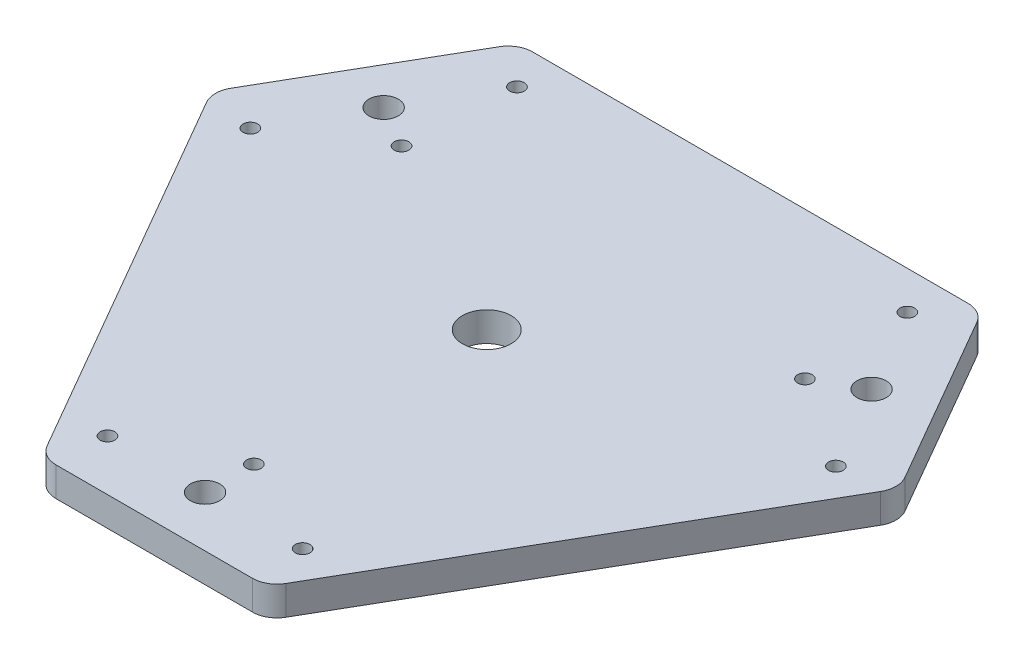
ISO-10303-21;
HEADER;
FILE_DESCRIPTION(('STEP AP214'),'2;1');
FILE_NAME('part.step','',(''),(''),'','','');
FILE_SCHEMA(('AUTOMOTIVE_DESIGN { 1 0 10303 214 1 1 1 1 }'));
ENDSEC;
DATA;
#1=APPLICATION_CONTEXT('core data for automotive mechanical design processes');
#2=APPLICATION_PROTOCOL_DEFINITION('international standard','automotive_design',2000,#1);
#3=PRODUCT_CONTEXT('',#1,'mechanical');
#4=PRODUCT('Part','Part','',(#3));
#5=PRODUCT_RELATED_PRODUCT_CATEGORY('part','',(#4));
#6=PRODUCT_DEFINITION_FORMATION('','',#4);
#7=PRODUCT_DEFINITION_CONTEXT('part definition',#1,'design');
#8=PRODUCT_DEFINITION('design','',#6,#7);
#9=PRODUCT_DEFINITION_SHAPE('','',#8);
#10=(LENGTH_UNIT() NAMED_UNIT(*) SI_UNIT(.MILLI.,.METRE.));
#11=(NAMED_UNIT(*) PLANE_ANGLE_UNIT() SI_UNIT($,.RADIAN.));
#12=(NAMED_UNIT(*) SI_UNIT($,.STERADIAN.) SOLID_ANGLE_UNIT());
#13=UNCERTAINTY_MEASURE_WITH_UNIT(LENGTH_MEASURE(1.E-05),#10,'distance_accuracy_value','');
#14=(GEOMETRIC_REPRESENTATION_CONTEXT(3) GLOBAL_UNCERTAINTY_ASSIGNED_CONTEXT((#13)) GLOBAL_UNIT_ASSIGNED_CONTEXT((#10,
#11,#12)) REPRESENTATION_CONTEXT('',''));
#15=CARTESIAN_POINT('',(0.,0.,0.));
#16=DIRECTION('',(0.,0.,1.));
#17=DIRECTION('',(1.,0.,0.));
#18=AXIS2_PLACEMENT_3D('',#15,#16,#17);
#19=CARTESIAN_POINT('',(-70.5153718043597,6.,-14.1362066797608));
#20=DIRECTION('',(0.866025403784439,0.,0.5));
#21=DIRECTION('',(0.5,0.,-0.866025403784439));
#22=AXIS2_PLACEMENT_3D('',#19,#20,#21);
#23=PLANE('',#22);
#24=DIRECTION('',(-0.5,0.,0.866025403784438));
#25=VECTOR('',#24,1.);
#26=CARTESIAN_POINT('',(-70.5153718043597,0.,-14.1362066797608));
#27=LINE('',#26,#25);
#28=CARTESIAN_POINT('',(-48.9433756729741,0.,-51.5));
#29=VERTEX_POINT('',#28);
#30=CARTESIAN_POINT('',(-69.0719961313856,0.,-16.6362066797608));
#31=VERTEX_POINT('',#30);
#32=EDGE_CURVE('E155',#29,#31,#27,.T.);
#33=ORIENTED_EDGE('',*,*,#32,.T.);
#34=DIRECTION('',(0.,-1.,0.));
#35=VECTOR('',#34,1.);
#36=CARTESIAN_POINT('',(-69.0719961313856,6.,-16.6362066797608));
#37=LINE('',#36,#35);
#38=CARTESIAN_POINT('',(-69.0719961313856,6.,-16.6362066797608));
#39=VERTEX_POINT('',#38);
#40=EDGE_CURVE('E132',#31,#39,#37,.F.);
#41=ORIENTED_EDGE('',*,*,#40,.T.);
#42=DIRECTION('',(-0.5,0.,0.866025403784438));
#43=VECTOR('',#42,1.);
#44=CARTESIAN_POINT('',(-70.5153718043597,6.,-14.1362066797608));
#45=LINE('',#44,#43);
#46=CARTESIAN_POINT('',(-48.9433756729741,6.,-51.5));
#47=VERTEX_POINT('',#46);
#48=EDGE_CURVE('E171',#47,#39,#45,.T.);
#49=ORIENTED_EDGE('',*,*,#48,.F.);
#50=DIRECTION('',(0.,-1.,0.));
#51=VECTOR('',#50,1.);
#52=CARTESIAN_POINT('',(-48.9433756729741,6.,-51.5));
#53=LINE('',#52,#51);
#54=EDGE_CURVE('E137',#47,#29,#53,.T.);
#55=ORIENTED_EDGE('',*,*,#54,.T.);
#56=EDGE_LOOP('',(#33,#41,#49,#55));
#57=FACE_BOUND('',#56,.T.);
#58=ADVANCED_FACE('F36',(#57),#23,.F.);
#59=CARTESIAN_POINT('',(-23.0153718043597,6.,68.1362066797608));
#60=DIRECTION('',(0.866025403784438,0.,-0.5));
#61=DIRECTION('',(-0.5,0.,-0.866025403784439));
#62=AXIS2_PLACEMENT_3D('',#59,#60,#61);
#63=PLANE('',#62);
#64=DIRECTION('',(0.5,0.,0.866025403784439));
#65=VECTOR('',#64,1.);
#66=CARTESIAN_POINT('',(-23.0153718043597,6.,68.1362066797608));
#67=LINE('',#66,#65);
#68=CARTESIAN_POINT('',(-69.0719961313856,6.,-11.6362066797608));
#69=VERTEX_POINT('',#68);
#70=CARTESIAN_POINT('',(-24.4587474773338,6.,65.6362066797608));
#71=VERTEX_POINT('',#70);
#72=EDGE_CURVE('E147',#69,#71,#67,.T.);
#73=ORIENTED_EDGE('',*,*,#72,.F.);
#74=DIRECTION('',(0.,-1.,0.));
#75=VECTOR('',#74,1.);
#76=CARTESIAN_POINT('',(-69.0719961313856,6.,-11.6362066797608));
#77=LINE('',#76,#75);
#78=CARTESIAN_POINT('',(-69.0719961313856,0.,-11.6362066797608));
#79=VERTEX_POINT('',#78);
#80=EDGE_CURVE('E131',#69,#79,#77,.T.);
#81=ORIENTED_EDGE('',*,*,#80,.T.);
#82=DIRECTION('',(0.5,0.,0.866025403784439));
#83=VECTOR('',#82,1.);
#84=CARTESIAN_POINT('',(-23.0153718043597,0.,68.1362066797608));
#85=LINE('',#84,#83);
#86=CARTESIAN_POINT('',(-24.4587474773338,0.,65.6362066797608));
#87=VERTEX_POINT('',#86);
#88=EDGE_CURVE('E144',#79,#87,#85,.T.);
#89=ORIENTED_EDGE('',*,*,#88,.T.);
#90=DIRECTION('',(0.,-1.,0.));
#91=VECTOR('',#90,1.);
#92=CARTESIAN_POINT('',(-24.4587474773338,6.,65.6362066797608));
#93=LINE('',#92,#91);
#94=EDGE_CURVE('E149',#87,#71,#93,.F.);
#95=ORIENTED_EDGE('',*,*,#94,.T.);
#96=EDGE_LOOP('',(#73,#81,#89,#95));
#97=FACE_BOUND('',#96,.T.);
#98=ADVANCED_FACE('F143',(#97),#63,.F.);
#99=CARTESIAN_POINT('',(23.0153718043597,6.,68.1362066797608));
#100=DIRECTION('',(0.,0.,-1.));
#101=DIRECTION('',(-1.,0.,0.));
#102=AXIS2_PLACEMENT_3D('',#99,#100,#101);
#103=PLANE('',#102);
#104=DIRECTION('',(1.,0.,0.));
#105=VECTOR('',#104,1.);
#106=CARTESIAN_POINT('',(23.0153718043597,6.,68.1362066797608));
#107=LINE('',#106,#105);
#108=CARTESIAN_POINT('',(-20.1286204584116,6.,68.1362066797608));
#109=VERTEX_POINT('',#108);
#110=CARTESIAN_POINT('',(20.1286204584116,6.,68.1362066797608));
#111=VERTEX_POINT('',#110);
#112=EDGE_CURVE('E213',#109,#111,#107,.T.);
#113=ORIENTED_EDGE('',*,*,#112,.F.);
#114=DIRECTION('',(0.,-1.,0.));
#115=VECTOR('',#114,1.);
#116=CARTESIAN_POINT('',(-20.1286204584116,6.,68.1362066797608));
#117=LINE('',#116,#115);
#118=CARTESIAN_POINT('',(-20.1286204584116,0.,68.1362066797608));
#119=VERTEX_POINT('',#118);
#120=EDGE_CURVE('E11',#109,#119,#117,.T.);
#121=ORIENTED_EDGE('',*,*,#120,.T.);
#122=DIRECTION('',(1.,0.,0.));
#123=VECTOR('',#122,1.);
#124=CARTESIAN_POINT('',(23.0153718043597,0.,68.1362066797608));
#125=LINE('',#124,#123);
#126=CARTESIAN_POINT('',(20.1286204584116,0.,68.1362066797608));
#127=VERTEX_POINT('',#126);
#128=EDGE_CURVE('E154',#119,#127,#125,.T.);
#129=ORIENTED_EDGE('',*,*,#128,.T.);
#130=DIRECTION('',(0.,-1.,0.));
#131=VECTOR('',#130,1.);
#132=CARTESIAN_POINT('',(20.1286204584116,6.,68.1362066797608));
#133=LINE('',#132,#131);
#134=EDGE_CURVE('E44',#127,#111,#133,.F.);
#135=ORIENTED_EDGE('',*,*,#134,.T.);
#136=EDGE_LOOP('',(#113,#121,#129,#135));
#137=FACE_BOUND('',#136,.T.);
#138=ADVANCED_FACE('F212',(#137),#103,.F.);
#139=CARTESIAN_POINT('',(70.5153718043597,6.,-14.1362066797608));
#140=DIRECTION('',(-0.866025403784438,0.,-0.5));
#141=DIRECTION('',(-0.5,0.,0.866025403784439));
#142=AXIS2_PLACEMENT_3D('',#139,#140,#141);
#143=PLANE('',#142);
#144=DIRECTION('',(0.5,0.,-0.866025403784439));
#145=VECTOR('',#144,1.);
#146=CARTESIAN_POINT('',(70.5153718043597,0.,-14.1362066797608));
#147=LINE('',#146,#145);
#148=CARTESIAN_POINT('',(24.4587474773338,0.,65.6362066797608));
#149=VERTEX_POINT('',#148);
#150=CARTESIAN_POINT('',(69.0719961313856,0.,-11.6362066797608));
#151=VERTEX_POINT('',#150);
#152=EDGE_CURVE('E158',#149,#151,#147,.T.);
#153=ORIENTED_EDGE('',*,*,#152,.T.);
#154=DIRECTION('',(0.,-1.,0.));
#155=VECTOR('',#154,1.);
#156=CARTESIAN_POINT('',(69.0719961313856,6.,-11.6362066797608));
#157=LINE('',#156,#155);
#158=CARTESIAN_POINT('',(69.0719961313856,6.,-11.6362066797608));
#159=VERTEX_POINT('',#158);
#160=EDGE_CURVE('E207',#151,#159,#157,.F.);
#161=ORIENTED_EDGE('',*,*,#160,.T.);
#162=DIRECTION('',(0.5,0.,-0.866025403784439));
#163=VECTOR('',#162,1.);
#164=CARTESIAN_POINT('',(70.5153718043597,6.,-14.1362066797608));
#165=LINE('',#164,#163);
#166=CARTESIAN_POINT('',(24.4587474773338,6.,65.6362066797608));
#167=VERTEX_POINT('',#166);
#168=EDGE_CURVE('E222',#167,#159,#165,.T.);
#169=ORIENTED_EDGE('',*,*,#168,.F.);
#170=DIRECTION('',(0.,-1.,0.));
#171=VECTOR('',#170,1.);
#172=CARTESIAN_POINT('',(24.4587474773338,6.,65.6362066797608));
#173=LINE('',#172,#171);
#174=EDGE_CURVE('E204',#167,#149,#173,.T.);
#175=ORIENTED_EDGE('',*,*,#174,.T.);
#176=EDGE_LOOP('',(#153,#161,#169,#175));
#177=FACE_BOUND('',#176,.T.);
#178=ADVANCED_FACE('F227',(#177),#143,.F.);
#179=CARTESIAN_POINT('',(47.5,6.,-54.));
#180=DIRECTION('',(-0.866025403784439,0.,0.5));
#181=DIRECTION('',(0.5,0.,0.866025403784439));
#182=AXIS2_PLACEMENT_3D('',#179,#180,#181);
#183=PLANE('',#182);
#184=DIRECTION('',(-0.5,0.,-0.866025403784438));
#185=VECTOR('',#184,1.);
#186=CARTESIAN_POINT('',(47.5,0.,-54.));
#187=LINE('',#186,#185);
#188=CARTESIAN_POINT('',(69.0719961313856,0.,-16.6362066797608));
#189=VERTEX_POINT('',#188);
#190=CARTESIAN_POINT('',(48.9433756729741,0.,-51.5));
#191=VERTEX_POINT('',#190);
#192=EDGE_CURVE('E166',#189,#191,#187,.T.);
#193=ORIENTED_EDGE('',*,*,#192,.T.);
#194=DIRECTION('',(0.,-1.,0.));
#195=VECTOR('',#194,1.);
#196=CARTESIAN_POINT('',(48.9433756729741,6.,-51.5));
#197=LINE('',#196,#195);
#198=CARTESIAN_POINT('',(48.9433756729741,6.,-51.5));
#199=VERTEX_POINT('',#198);
#200=EDGE_CURVE('E202',#191,#199,#197,.F.);
#201=ORIENTED_EDGE('',*,*,#200,.T.);
#202=DIRECTION('',(-0.5,0.,-0.866025403784438));
#203=VECTOR('',#202,1.);
#204=CARTESIAN_POINT('',(47.5,6.,-54.));
#205=LINE('',#204,#203);
#206=CARTESIAN_POINT('',(69.0719961313856,6.,-16.6362066797608));
#207=VERTEX_POINT('',#206);
#208=EDGE_CURVE('E238',#207,#199,#205,.T.);
#209=ORIENTED_EDGE('',*,*,#208,.F.);
#210=DIRECTION('',(0.,-1.,0.));
#211=VECTOR('',#210,1.);
#212=CARTESIAN_POINT('',(69.0719961313856,6.,-16.6362066797608));
#213=LINE('',#212,#211);
#214=EDGE_CURVE('E199',#207,#189,#213,.T.);
#215=ORIENTED_EDGE('',*,*,#214,.T.);
#216=EDGE_LOOP('',(#193,#201,#209,#215));
#217=FACE_BOUND('',#216,.T.);
#218=ADVANCED_FACE('F236',(#217),#183,.F.);
#219=CARTESIAN_POINT('',(-47.5,6.,-54.));
#220=DIRECTION('',(0.,0.,1.));
#221=DIRECTION('',(1.,0.,0.));
#222=AXIS2_PLACEMENT_3D('',#219,#220,#221);
#223=PLANE('',#222);
#224=DIRECTION('',(-1.,0.,0.));
#225=VECTOR('',#224,1.);
#226=CARTESIAN_POINT('',(-47.5,0.,-54.));
#227=LINE('',#226,#225);
#228=CARTESIAN_POINT('',(44.6132486540519,0.,-54.));
#229=VERTEX_POINT('',#228);
#230=CARTESIAN_POINT('',(-44.6132486540519,0.,-54.));
#231=VERTEX_POINT('',#230);
#232=EDGE_CURVE('E169',#229,#231,#227,.T.);
#233=ORIENTED_EDGE('',*,*,#232,.T.);
#234=DIRECTION('',(0.,-1.,0.));
#235=VECTOR('',#234,1.);
#236=CARTESIAN_POINT('',(-44.6132486540519,6.,-54.));
#237=LINE('',#236,#235);
#238=CARTESIAN_POINT('',(-44.6132486540519,6.,-54.));
#239=VERTEX_POINT('',#238);
#240=EDGE_CURVE('E51',#231,#239,#237,.F.);
#241=ORIENTED_EDGE('',*,*,#240,.T.);
#242=DIRECTION('',(-1.,0.,0.));
#243=VECTOR('',#242,1.);
#244=CARTESIAN_POINT('',(-47.5,6.,-54.));
#245=LINE('',#244,#243);
#246=CARTESIAN_POINT('',(44.6132486540519,6.,-54.));
#247=VERTEX_POINT('',#246);
#248=EDGE_CURVE('E172',#247,#239,#245,.T.);
#249=ORIENTED_EDGE('',*,*,#248,.F.);
#250=DIRECTION('',(0.,-1.,0.));
#251=VECTOR('',#250,1.);
#252=CARTESIAN_POINT('',(44.6132486540519,6.,-54.));
#253=LINE('',#252,#251);
#254=EDGE_CURVE('E195',#247,#229,#253,.T.);
#255=ORIENTED_EDGE('',*,*,#254,.T.);
#256=EDGE_LOOP('',(#233,#241,#249,#255));
#257=FACE_BOUND('',#256,.T.);
#258=ADVANCED_FACE('F332',(#257),#223,.F.);
#259=CARTESIAN_POINT('',(0.,6.,0.));
#260=DIRECTION('',(0.,-1.,0.));
#261=DIRECTION('',(0.,0.,-1.));
#262=AXIS2_PLACEMENT_3D('',#259,#260,#261);
#263=PLANE('',#262);
#264=CARTESIAN_POINT('',(0.,6.,0.));
#265=DIRECTION('',(0.,1.,0.));
#266=DIRECTION('',(0.,0.,1.));
#267=AXIS2_PLACEMENT_3D('',#264,#265,#266);
#268=CIRCLE('',#267,5.);
#269=CARTESIAN_POINT('',(0.,6.,5.));
#270=VERTEX_POINT('',#269);
#271=EDGE_CURVE('E316',#270,#270,#268,.T.);
#272=ORIENTED_EDGE('',*,*,#271,.F.);
#273=EDGE_LOOP('',(#272));
#274=FACE_BOUND('',#273,.T.);
#275=CARTESIAN_POINT('',(60.0000000000002,6.,-11.547005383792));
#276=DIRECTION('',(0.,1.,0.));
#277=DIRECTION('',(0.,0.,1.));
#278=AXIS2_PLACEMENT_3D('',#275,#276,#277);
#279=CIRCLE('',#278,1.50000000000001);
#280=CARTESIAN_POINT('',(60.0000000000002,6.,-10.047005383792));
#281=VERTEX_POINT('',#280);
#282=EDGE_CURVE('E257',#281,#281,#279,.T.);
#283=ORIENTED_EDGE('',*,*,#282,.F.);
#284=EDGE_LOOP('',(#283));
#285=FACE_BOUND('',#284,.T.);
#286=CARTESIAN_POINT('',(40.0000000000005,6.,-46.1880215351697));
#287=DIRECTION('',(0.,1.,0.));
#288=DIRECTION('',(0.,0.,1.));
#289=AXIS2_PLACEMENT_3D('',#286,#287,#288);
#290=CIRCLE('',#289,1.5);
#291=CARTESIAN_POINT('',(40.0000000000005,6.,-44.6880215351697));
#292=VERTEX_POINT('',#291);
#293=EDGE_CURVE('E250',#292,#292,#290,.T.);
#294=ORIENTED_EDGE('',*,*,#293,.F.);
#295=EDGE_LOOP('',(#294));
#296=FACE_BOUND('',#295,.T.);
#297=CARTESIAN_POINT('',(41.3397459621559,6.,-23.8675134594809));
#298=DIRECTION('',(0.,1.,0.));
#299=DIRECTION('',(0.,0.,1.));
#300=AXIS2_PLACEMENT_3D('',#297,#298,#299);
#301=CIRCLE('',#300,1.5);
#302=CARTESIAN_POINT('',(41.3397459621559,6.,-22.3675134594809));
#303=VERTEX_POINT('',#302);
#304=EDGE_CURVE('E264',#303,#303,#301,.T.);
#305=ORIENTED_EDGE('',*,*,#304,.F.);
#306=EDGE_LOOP('',(#305));
#307=FACE_BOUND('',#306,.T.);
#308=CARTESIAN_POINT('',(20.,6.,57.7350269189626));
#309=DIRECTION('',(0.,1.,0.));
#310=DIRECTION('',(0.,0.,1.));
#311=AXIS2_PLACEMENT_3D('',#308,#309,#310);
#312=CIRCLE('',#311,1.5);
#313=CARTESIAN_POINT('',(20.,6.,59.2350269189626));
#314=VERTEX_POINT('',#313);
#315=EDGE_CURVE('E282',#314,#314,#312,.T.);
#316=ORIENTED_EDGE('',*,*,#315,.F.);
#317=EDGE_LOOP('',(#316));
#318=FACE_BOUND('',#317,.T.);
#319=CARTESIAN_POINT('',(-20.,6.,57.7350269189626));
#320=DIRECTION('',(0.,1.,0.));
#321=DIRECTION('',(0.,0.,1.));
#322=AXIS2_PLACEMENT_3D('',#319,#320,#321);
#323=CIRCLE('',#322,1.5);
#324=CARTESIAN_POINT('',(-20.,6.,59.2350269189626));
#325=VERTEX_POINT('',#324);
#326=EDGE_CURVE('E289',#325,#325,#323,.T.);
#327=ORIENTED_EDGE('',*,*,#326,.F.);
#328=EDGE_LOOP('',(#327));
#329=FACE_BOUND('',#328,.T.);
#330=CARTESIAN_POINT('',(0.,6.,57.7350269189626));
#331=DIRECTION('',(0.,1.,0.));
#332=DIRECTION('',(0.,0.,1.));
#333=AXIS2_PLACEMENT_3D('',#330,#331,#332);
#334=CIRCLE('',#333,3.);
#335=CARTESIAN_POINT('',(0.,6.,60.7350269189626));
#336=VERTEX_POINT('',#335);
#337=EDGE_CURVE('E270',#336,#336,#334,.T.);
#338=ORIENTED_EDGE('',*,*,#337,.F.);
#339=EDGE_LOOP('',(#338));
#340=FACE_BOUND('',#339,.T.);
#341=CARTESIAN_POINT('',(-50.,6.,-28.8675134594813));
#342=DIRECTION('',(0.,1.,0.));
#343=DIRECTION('',(0.,0.,1.));
#344=AXIS2_PLACEMENT_3D('',#341,#342,#343);
#345=CIRCLE('',#344,3.);
#346=CARTESIAN_POINT('',(-50.,6.,-25.8675134594813));
#347=VERTEX_POINT('',#346);
#348=EDGE_CURVE('E277',#347,#347,#345,.T.);
#349=ORIENTED_EDGE('',*,*,#348,.F.);
#350=EDGE_LOOP('',(#349));
#351=FACE_BOUND('',#350,.T.);
#352=CARTESIAN_POINT('',(-41.3397459621555,6.,-23.8675134594815));
#353=DIRECTION('',(0.,1.,0.));
#354=DIRECTION('',(0.,0.,1.));
#355=AXIS2_PLACEMENT_3D('',#352,#353,#354);
#356=CIRCLE('',#355,1.5);
#357=CARTESIAN_POINT('',(-41.3397459621555,6.,-22.3675134594815));
#358=VERTEX_POINT('',#357);
#359=EDGE_CURVE('E263',#358,#358,#356,.T.);
#360=ORIENTED_EDGE('',*,*,#359,.F.);
#361=EDGE_LOOP('',(#360));
#362=FACE_BOUND('',#361,.T.);
#363=CARTESIAN_POINT('',(-60.,6.,-11.5470053837928));
#364=DIRECTION('',(0.,1.,0.));
#365=DIRECTION('',(0.,0.,1.));
#366=AXIS2_PLACEMENT_3D('',#363,#364,#365);
#367=CIRCLE('',#366,1.5);
#368=CARTESIAN_POINT('',(-60.,6.,-10.0470053837928));
#369=VERTEX_POINT('',#368);
#370=EDGE_CURVE('E311',#369,#369,#367,.T.);
#371=ORIENTED_EDGE('',*,*,#370,.F.);
#372=EDGE_LOOP('',(#371));
#373=FACE_BOUND('',#372,.T.);
#374=CARTESIAN_POINT('',(-39.9999999999998,6.,-46.1880215351703));
#375=DIRECTION('',(0.,1.,0.));
#376=DIRECTION('',(0.,0.,1.));
#377=AXIS2_PLACEMENT_3D('',#374,#375,#376);
#378=CIRCLE('',#377,1.5);
#379=CARTESIAN_POINT('',(-39.9999999999998,6.,-44.6880215351703));
#380=VERTEX_POINT('',#379);
#381=EDGE_CURVE('E294',#380,#380,#378,.T.);
#382=ORIENTED_EDGE('',*,*,#381,.F.);
#383=EDGE_LOOP('',(#382));
#384=FACE_BOUND('',#383,.T.);
#385=CARTESIAN_POINT('',(0.,6.,47.7350269189626));
#386=DIRECTION('',(0.,1.,0.));
#387=DIRECTION('',(0.,0.,1.));
#388=AXIS2_PLACEMENT_3D('',#385,#386,#387);
#389=CIRCLE('',#388,1.5);
#390=CARTESIAN_POINT('',(0.,6.,49.2350269189626));
#391=VERTEX_POINT('',#390);
#392=EDGE_CURVE('E301',#391,#391,#389,.T.);
#393=ORIENTED_EDGE('',*,*,#392,.F.);
#394=EDGE_LOOP('',(#393));
#395=FACE_BOUND('',#394,.T.);
#396=CARTESIAN_POINT('',(50.,6.,-28.8675134594813));
#397=DIRECTION('',(0.,1.,0.));
#398=DIRECTION('',(0.,0.,1.));
#399=AXIS2_PLACEMENT_3D('',#396,#397,#398);
#400=CIRCLE('',#399,3.);
#401=CARTESIAN_POINT('',(50.,6.,-25.8675134594813));
#402=VERTEX_POINT('',#401);
#403=EDGE_CURVE('E244',#402,#402,#400,.T.);
#404=ORIENTED_EDGE('',*,*,#403,.F.);
#405=EDGE_LOOP('',(#404));
#406=FACE_BOUND('',#405,.T.);
#407=ORIENTED_EDGE('',*,*,#48,.T.);
#408=CARTESIAN_POINT('',(-64.7418691124634,6.,-14.1362066797608));
#409=DIRECTION('',(0.,-1.,0.));
#410=DIRECTION('',(0.,0.,-1.));
#411=AXIS2_PLACEMENT_3D('',#408,#409,#410);
#412=CIRCLE('',#411,5.);
#413=EDGE_CURVE('E193',#39,#69,#412,.F.);
#414=ORIENTED_EDGE('',*,*,#413,.T.);
#415=ORIENTED_EDGE('',*,*,#72,.T.);
#416=CARTESIAN_POINT('',(-20.1286204584116,6.,63.1362066797608));
#417=DIRECTION('',(0.,-1.,0.));
#418=DIRECTION('',(0.,0.,-1.));
#419=AXIS2_PLACEMENT_3D('',#416,#417,#418);
#420=CIRCLE('',#419,5.);
#421=EDGE_CURVE('E186',#71,#109,#420,.F.);
#422=ORIENTED_EDGE('',*,*,#421,.T.);
#423=ORIENTED_EDGE('',*,*,#112,.T.);
#424=CARTESIAN_POINT('',(20.1286204584116,6.,63.1362066797608));
#425=DIRECTION('',(0.,-1.,0.));
#426=DIRECTION('',(0.,0.,-1.));
#427=AXIS2_PLACEMENT_3D('',#424,#425,#426);
#428=CIRCLE('',#427,5.);
#429=EDGE_CURVE('E184',#111,#167,#428,.F.);
#430=ORIENTED_EDGE('',*,*,#429,.T.);
#431=ORIENTED_EDGE('',*,*,#168,.T.);
#432=CARTESIAN_POINT('',(64.7418691124634,6.,-14.1362066797608));
#433=DIRECTION('',(0.,-1.,0.));
#434=DIRECTION('',(0.,0.,-1.));
#435=AXIS2_PLACEMENT_3D('',#432,#433,#434);
#436=CIRCLE('',#435,5.);
#437=EDGE_CURVE('E188',#159,#207,#436,.F.);
#438=ORIENTED_EDGE('',*,*,#437,.T.);
#439=ORIENTED_EDGE('',*,*,#208,.T.);
#440=CARTESIAN_POINT('',(44.6132486540519,6.,-49.));
#441=DIRECTION('',(0.,-1.,0.));
#442=DIRECTION('',(0.,0.,-1.));
#443=AXIS2_PLACEMENT_3D('',#440,#441,#442);
#444=CIRCLE('',#443,5.);
#445=EDGE_CURVE('E58',#199,#247,#444,.F.);
#446=ORIENTED_EDGE('',*,*,#445,.T.);
#447=ORIENTED_EDGE('',*,*,#248,.T.);
#448=CARTESIAN_POINT('',(-44.6132486540519,6.,-49.));
#449=DIRECTION('',(0.,-1.,0.));
#450=DIRECTION('',(0.,0.,-1.));
#451=AXIS2_PLACEMENT_3D('',#448,#449,#450);
#452=CIRCLE('',#451,5.);
#453=EDGE_CURVE('E191',#239,#47,#452,.F.);
#454=ORIENTED_EDGE('',*,*,#453,.T.);
#455=EDGE_LOOP('',(#407,#414,#415,#422,#423,#430,#431,#438,#439,#446,#447,#454));
#456=FACE_BOUND('',#455,.T.);
#457=ADVANCED_FACE('F218',(#274,#285,#296,#307,#318,#329,#340,#351,#362,#373,#384,#395,#406,
#456),#263,.F.);
#458=CARTESIAN_POINT('',(0.,0.,0.));
#459=DIRECTION('',(0.,-1.,0.));
#460=DIRECTION('',(0.,0.,-1.));
#461=AXIS2_PLACEMENT_3D('',#458,#459,#460);
#462=PLANE('',#461);
#463=CARTESIAN_POINT('',(0.,0.,0.));
#464=DIRECTION('',(0.,1.,0.));
#465=DIRECTION('',(0.,0.,1.));
#466=AXIS2_PLACEMENT_3D('',#463,#464,#465);
#467=CIRCLE('',#466,5.);
#468=CARTESIAN_POINT('',(0.,0.,5.));
#469=VERTEX_POINT('',#468);
#470=EDGE_CURVE('E267',#469,#469,#467,.T.);
#471=ORIENTED_EDGE('',*,*,#470,.T.);
#472=EDGE_LOOP('',(#471));
#473=FACE_BOUND('',#472,.T.);
#474=CARTESIAN_POINT('',(60.0000000000002,0.,-11.547005383792));
#475=DIRECTION('',(0.,1.,0.));
#476=DIRECTION('',(0.,0.,1.));
#477=AXIS2_PLACEMENT_3D('',#474,#475,#476);
#478=CIRCLE('',#477,1.50000000000001);
#479=CARTESIAN_POINT('',(60.0000000000002,0.,-10.047005383792));
#480=VERTEX_POINT('',#479);
#481=EDGE_CURVE('E260',#480,#480,#478,.T.);
#482=ORIENTED_EDGE('',*,*,#481,.T.);
#483=EDGE_LOOP('',(#482));
#484=FACE_BOUND('',#483,.T.);
#485=CARTESIAN_POINT('',(40.0000000000005,0.,-46.1880215351697));
#486=DIRECTION('',(0.,1.,0.));
#487=DIRECTION('',(0.,0.,1.));
#488=AXIS2_PLACEMENT_3D('',#485,#486,#487);
#489=CIRCLE('',#488,1.5);
#490=CARTESIAN_POINT('',(40.0000000000005,0.,-44.6880215351697));
#491=VERTEX_POINT('',#490);
#492=EDGE_CURVE('E253',#491,#491,#489,.T.);
#493=ORIENTED_EDGE('',*,*,#492,.T.);
#494=EDGE_LOOP('',(#493));
#495=FACE_BOUND('',#494,.T.);
#496=CARTESIAN_POINT('',(41.3397459621559,0.,-23.8675134594809));
#497=DIRECTION('',(0.,1.,0.));
#498=DIRECTION('',(0.,0.,1.));
#499=AXIS2_PLACEMENT_3D('',#496,#497,#498);
#500=CIRCLE('',#499,1.5);
#501=CARTESIAN_POINT('',(41.3397459621559,0.,-22.3675134594809));
#502=VERTEX_POINT('',#501);
#503=EDGE_CURVE('E254',#502,#502,#500,.T.);
#504=ORIENTED_EDGE('',*,*,#503,.T.);
#505=EDGE_LOOP('',(#504));
#506=FACE_BOUND('',#505,.T.);
#507=CARTESIAN_POINT('',(20.,0.,57.7350269189626));
#508=DIRECTION('',(0.,1.,0.));
#509=DIRECTION('',(0.,0.,1.));
#510=AXIS2_PLACEMENT_3D('',#507,#508,#509);
#511=CIRCLE('',#510,1.5);
#512=CARTESIAN_POINT('',(20.,0.,59.2350269189626));
#513=VERTEX_POINT('',#512);
#514=EDGE_CURVE('E285',#513,#513,#511,.T.);
#515=ORIENTED_EDGE('',*,*,#514,.T.);
#516=EDGE_LOOP('',(#515));
#517=FACE_BOUND('',#516,.T.);
#518=CARTESIAN_POINT('',(-20.,0.,57.7350269189626));
#519=DIRECTION('',(0.,1.,0.));
#520=DIRECTION('',(0.,0.,1.));
#521=AXIS2_PLACEMENT_3D('',#518,#519,#520);
#522=CIRCLE('',#521,1.5);
#523=CARTESIAN_POINT('',(-20.,0.,59.2350269189626));
#524=VERTEX_POINT('',#523);
#525=EDGE_CURVE('E274',#524,#524,#522,.T.);
#526=ORIENTED_EDGE('',*,*,#525,.T.);
#527=EDGE_LOOP('',(#526));
#528=FACE_BOUND('',#527,.T.);
#529=CARTESIAN_POINT('',(0.,0.,57.7350269189626));
#530=DIRECTION('',(0.,1.,0.));
#531=DIRECTION('',(0.,0.,1.));
#532=AXIS2_PLACEMENT_3D('',#529,#530,#531);
#533=CIRCLE('',#532,3.);
#534=CARTESIAN_POINT('',(0.,0.,60.7350269189626));
#535=VERTEX_POINT('',#534);
#536=EDGE_CURVE('E273',#535,#535,#533,.T.);
#537=ORIENTED_EDGE('',*,*,#536,.T.);
#538=EDGE_LOOP('',(#537));
#539=FACE_BOUND('',#538,.T.);
#540=CARTESIAN_POINT('',(-50.,0.,-28.8675134594813));
#541=DIRECTION('',(0.,1.,0.));
#542=DIRECTION('',(0.,0.,1.));
#543=AXIS2_PLACEMENT_3D('',#540,#541,#542);
#544=CIRCLE('',#543,3.);
#545=CARTESIAN_POINT('',(-50.,0.,-25.8675134594813));
#546=VERTEX_POINT('',#545);
#547=EDGE_CURVE('E247',#546,#546,#544,.T.);
#548=ORIENTED_EDGE('',*,*,#547,.T.);
#549=EDGE_LOOP('',(#548));
#550=FACE_BOUND('',#549,.T.);
#551=CARTESIAN_POINT('',(-41.3397459621555,0.,-23.8675134594815));
#552=DIRECTION('',(0.,1.,0.));
#553=DIRECTION('',(0.,0.,1.));
#554=AXIS2_PLACEMENT_3D('',#551,#552,#553);
#555=CIRCLE('',#554,1.5);
#556=CARTESIAN_POINT('',(-41.3397459621555,0.,-22.3675134594815));
#557=VERTEX_POINT('',#556);
#558=EDGE_CURVE('E308',#557,#557,#555,.T.);
#559=ORIENTED_EDGE('',*,*,#558,.T.);
#560=EDGE_LOOP('',(#559));
#561=FACE_BOUND('',#560,.T.);
#562=CARTESIAN_POINT('',(-60.,0.,-11.5470053837928));
#563=DIRECTION('',(0.,1.,0.));
#564=DIRECTION('',(0.,0.,1.));
#565=AXIS2_PLACEMENT_3D('',#562,#563,#564);
#566=CIRCLE('',#565,1.5);
#567=CARTESIAN_POINT('',(-60.,0.,-10.0470053837928));
#568=VERTEX_POINT('',#567);
#569=EDGE_CURVE('E298',#568,#568,#566,.T.);
#570=ORIENTED_EDGE('',*,*,#569,.T.);
#571=EDGE_LOOP('',(#570));
#572=FACE_BOUND('',#571,.T.);
#573=CARTESIAN_POINT('',(-39.9999999999998,0.,-46.1880215351703));
#574=DIRECTION('',(0.,1.,0.));
#575=DIRECTION('',(0.,0.,1.));
#576=AXIS2_PLACEMENT_3D('',#573,#574,#575);
#577=CIRCLE('',#576,1.5);
#578=CARTESIAN_POINT('',(-39.9999999999998,0.,-44.6880215351703));
#579=VERTEX_POINT('',#578);
#580=EDGE_CURVE('E297',#579,#579,#577,.T.);
#581=ORIENTED_EDGE('',*,*,#580,.T.);
#582=EDGE_LOOP('',(#581));
#583=FACE_BOUND('',#582,.T.);
#584=CARTESIAN_POINT('',(0.,0.,47.7350269189626));
#585=DIRECTION('',(0.,1.,0.));
#586=DIRECTION('',(0.,0.,1.));
#587=AXIS2_PLACEMENT_3D('',#584,#585,#586);
#588=CIRCLE('',#587,1.5);
#589=CARTESIAN_POINT('',(0.,0.,49.2350269189626));
#590=VERTEX_POINT('',#589);
#591=EDGE_CURVE('E286',#590,#590,#588,.T.);
#592=ORIENTED_EDGE('',*,*,#591,.T.);
#593=EDGE_LOOP('',(#592));
#594=FACE_BOUND('',#593,.T.);
#595=CARTESIAN_POINT('',(50.,0.,-28.8675134594813));
#596=DIRECTION('',(0.,1.,0.));
#597=DIRECTION('',(0.,0.,1.));
#598=AXIS2_PLACEMENT_3D('',#595,#596,#597);
#599=CIRCLE('',#598,3.);
#600=CARTESIAN_POINT('',(50.,0.,-25.8675134594813));
#601=VERTEX_POINT('',#600);
#602=EDGE_CURVE('E160',#601,#601,#599,.T.);
#603=ORIENTED_EDGE('',*,*,#602,.T.);
#604=EDGE_LOOP('',(#603));
#605=FACE_BOUND('',#604,.T.);
#606=ORIENTED_EDGE('',*,*,#88,.F.);
#607=CARTESIAN_POINT('',(-64.7418691124634,0.,-14.1362066797608));
#608=DIRECTION('',(0.,-1.,0.));
#609=DIRECTION('',(0.,0.,-1.));
#610=AXIS2_PLACEMENT_3D('',#607,#608,#609);
#611=CIRCLE('',#610,5.);
#612=EDGE_CURVE('E127',#79,#31,#611,.T.);
#613=ORIENTED_EDGE('',*,*,#612,.T.);
#614=ORIENTED_EDGE('',*,*,#32,.F.);
#615=CARTESIAN_POINT('',(-44.6132486540519,0.,-49.));
#616=DIRECTION('',(0.,-1.,0.));
#617=DIRECTION('',(0.,0.,-1.));
#618=AXIS2_PLACEMENT_3D('',#615,#616,#617);
#619=CIRCLE('',#618,5.);
#620=EDGE_CURVE('E138',#29,#231,#619,.T.);
#621=ORIENTED_EDGE('',*,*,#620,.T.);
#622=ORIENTED_EDGE('',*,*,#232,.F.);
#623=CARTESIAN_POINT('',(44.6132486540519,0.,-49.));
#624=DIRECTION('',(0.,-1.,0.));
#625=DIRECTION('',(0.,0.,-1.));
#626=AXIS2_PLACEMENT_3D('',#623,#624,#625);
#627=CIRCLE('',#626,5.);
#628=EDGE_CURVE('E178',#229,#191,#627,.T.);
#629=ORIENTED_EDGE('',*,*,#628,.T.);
#630=ORIENTED_EDGE('',*,*,#192,.F.);
#631=CARTESIAN_POINT('',(64.7418691124634,0.,-14.1362066797608));
#632=DIRECTION('',(0.,-1.,0.));
#633=DIRECTION('',(0.,0.,-1.));
#634=AXIS2_PLACEMENT_3D('',#631,#632,#633);
#635=CIRCLE('',#634,5.);
#636=EDGE_CURVE('E176',#189,#151,#635,.T.);
#637=ORIENTED_EDGE('',*,*,#636,.T.);
#638=ORIENTED_EDGE('',*,*,#152,.F.);
#639=CARTESIAN_POINT('',(20.1286204584116,0.,63.1362066797608));
#640=DIRECTION('',(0.,-1.,0.));
#641=DIRECTION('',(0.,0.,-1.));
#642=AXIS2_PLACEMENT_3D('',#639,#640,#641);
#643=CIRCLE('',#642,5.);
#644=EDGE_CURVE('E148',#149,#127,#643,.T.);
#645=ORIENTED_EDGE('',*,*,#644,.T.);
#646=ORIENTED_EDGE('',*,*,#128,.F.);
#647=CARTESIAN_POINT('',(-20.1286204584116,0.,63.1362066797608));
#648=DIRECTION('',(0.,-1.,0.));
#649=DIRECTION('',(0.,0.,-1.));
#650=AXIS2_PLACEMENT_3D('',#647,#648,#649);
#651=CIRCLE('',#650,5.);
#652=EDGE_CURVE('E153',#119,#87,#651,.T.);
#653=ORIENTED_EDGE('',*,*,#652,.T.);
#654=EDGE_LOOP('',(#606,#613,#614,#621,#622,#629,#630,#637,#638,#645,#646,#653));
#655=FACE_BOUND('',#654,.T.);
#656=ADVANCED_FACE('F151',(#473,#484,#495,#506,#517,#528,#539,#550,#561,#572,#583,#594,#605,
#655),#462,.T.);
#657=CARTESIAN_POINT('',(50.,0.,-28.8675134594813));
#658=DIRECTION('',(0.,1.,0.));
#659=DIRECTION('',(0.,0.,1.));
#660=AXIS2_PLACEMENT_3D('',#657,#658,#659);
#661=CYLINDRICAL_SURFACE('',#660,3.);
#662=ORIENTED_EDGE('',*,*,#602,.F.);
#663=EDGE_LOOP('',(#662));
#664=FACE_BOUND('',#663,.T.);
#665=ORIENTED_EDGE('',*,*,#403,.T.);
#666=EDGE_LOOP('',(#665));
#667=FACE_BOUND('',#666,.T.);
#668=ADVANCED_FACE('F358',(#664,#667),#661,.F.);
#669=CARTESIAN_POINT('',(0.,0.,47.7350269189626));
#670=DIRECTION('',(0.,1.,0.));
#671=DIRECTION('',(0.,0.,1.));
#672=AXIS2_PLACEMENT_3D('',#669,#670,#671);
#673=CYLINDRICAL_SURFACE('',#672,1.5);
#674=ORIENTED_EDGE('',*,*,#591,.F.);
#675=EDGE_LOOP('',(#674));
#676=FACE_BOUND('',#675,.T.);
#677=ORIENTED_EDGE('',*,*,#392,.T.);
#678=EDGE_LOOP('',(#677));
#679=FACE_BOUND('',#678,.T.);
#680=ADVANCED_FACE('F360',(#676,#679),#673,.F.);
#681=CARTESIAN_POINT('',(-39.9999999999998,0.,-46.1880215351703));
#682=DIRECTION('',(0.,1.,0.));
#683=DIRECTION('',(0.,0.,1.));
#684=AXIS2_PLACEMENT_3D('',#681,#682,#683);
#685=CYLINDRICAL_SURFACE('',#684,1.5);
#686=ORIENTED_EDGE('',*,*,#580,.F.);
#687=EDGE_LOOP('',(#686));
#688=FACE_BOUND('',#687,.T.);
#689=ORIENTED_EDGE('',*,*,#381,.T.);
#690=EDGE_LOOP('',(#689));
#691=FACE_BOUND('',#690,.T.);
#692=ADVANCED_FACE('F367',(#688,#691),#685,.F.);
#693=CARTESIAN_POINT('',(-60.,0.,-11.5470053837928));
#694=DIRECTION('',(0.,1.,0.));
#695=DIRECTION('',(0.,0.,1.));
#696=AXIS2_PLACEMENT_3D('',#693,#694,#695);
#697=CYLINDRICAL_SURFACE('',#696,1.5);
#698=ORIENTED_EDGE('',*,*,#569,.F.);
#699=EDGE_LOOP('',(#698));
#700=FACE_BOUND('',#699,.T.);
#701=ORIENTED_EDGE('',*,*,#370,.T.);
#702=EDGE_LOOP('',(#701));
#703=FACE_BOUND('',#702,.T.);
#704=ADVANCED_FACE('F503',(#700,#703),#697,.F.);
#705=CARTESIAN_POINT('',(-41.3397459621555,0.,-23.8675134594815));
#706=DIRECTION('',(0.,1.,0.));
#707=DIRECTION('',(0.,0.,1.));
#708=AXIS2_PLACEMENT_3D('',#705,#706,#707);
#709=CYLINDRICAL_SURFACE('',#708,1.5);
#710=ORIENTED_EDGE('',*,*,#558,.F.);
#711=EDGE_LOOP('',(#710));
#712=FACE_BOUND('',#711,.T.);
#713=ORIENTED_EDGE('',*,*,#359,.T.);
#714=EDGE_LOOP('',(#713));
#715=FACE_BOUND('',#714,.T.);
#716=ADVANCED_FACE('F512',(#712,#715),#709,.F.);
#717=CARTESIAN_POINT('',(-50.,0.,-28.8675134594813));
#718=DIRECTION('',(0.,1.,0.));
#719=DIRECTION('',(0.,0.,1.));
#720=AXIS2_PLACEMENT_3D('',#717,#718,#719);
#721=CYLINDRICAL_SURFACE('',#720,3.);
#722=ORIENTED_EDGE('',*,*,#547,.F.);
#723=EDGE_LOOP('',(#722));
#724=FACE_BOUND('',#723,.T.);
#725=ORIENTED_EDGE('',*,*,#348,.T.);
#726=EDGE_LOOP('',(#725));
#727=FACE_BOUND('',#726,.T.);
#728=ADVANCED_FACE('F521',(#724,#727),#721,.F.);
#729=CARTESIAN_POINT('',(0.,0.,57.7350269189626));
#730=DIRECTION('',(0.,1.,0.));
#731=DIRECTION('',(0.,0.,1.));
#732=AXIS2_PLACEMENT_3D('',#729,#730,#731);
#733=CYLINDRICAL_SURFACE('',#732,3.);
#734=ORIENTED_EDGE('',*,*,#536,.F.);
#735=EDGE_LOOP('',(#734));
#736=FACE_BOUND('',#735,.T.);
#737=ORIENTED_EDGE('',*,*,#337,.T.);
#738=EDGE_LOOP('',(#737));
#739=FACE_BOUND('',#738,.T.);
#740=ADVANCED_FACE('F530',(#736,#739),#733,.F.);
#741=CARTESIAN_POINT('',(-20.,0.,57.7350269189626));
#742=DIRECTION('',(0.,1.,0.));
#743=DIRECTION('',(0.,0.,1.));
#744=AXIS2_PLACEMENT_3D('',#741,#742,#743);
#745=CYLINDRICAL_SURFACE('',#744,1.5);
#746=ORIENTED_EDGE('',*,*,#525,.F.);
#747=EDGE_LOOP('',(#746));
#748=FACE_BOUND('',#747,.T.);
#749=ORIENTED_EDGE('',*,*,#326,.T.);
#750=EDGE_LOOP('',(#749));
#751=FACE_BOUND('',#750,.T.);
#752=ADVANCED_FACE('F539',(#748,#751),#745,.F.);
#753=CARTESIAN_POINT('',(20.,0.,57.7350269189626));
#754=DIRECTION('',(0.,1.,0.));
#755=DIRECTION('',(0.,0.,1.));
#756=AXIS2_PLACEMENT_3D('',#753,#754,#755);
#757=CYLINDRICAL_SURFACE('',#756,1.5);
#758=ORIENTED_EDGE('',*,*,#514,.F.);
#759=EDGE_LOOP('',(#758));
#760=FACE_BOUND('',#759,.T.);
#761=ORIENTED_EDGE('',*,*,#315,.T.);
#762=EDGE_LOOP('',(#761));
#763=FACE_BOUND('',#762,.T.);
#764=ADVANCED_FACE('F548',(#760,#763),#757,.F.);
#765=CARTESIAN_POINT('',(41.3397459621559,0.,-23.8675134594809));
#766=DIRECTION('',(0.,1.,0.));
#767=DIRECTION('',(0.,0.,1.));
#768=AXIS2_PLACEMENT_3D('',#765,#766,#767);
#769=CYLINDRICAL_SURFACE('',#768,1.5);
#770=ORIENTED_EDGE('',*,*,#503,.F.);
#771=EDGE_LOOP('',(#770));
#772=FACE_BOUND('',#771,.T.);
#773=ORIENTED_EDGE('',*,*,#304,.T.);
#774=EDGE_LOOP('',(#773));
#775=FACE_BOUND('',#774,.T.);
#776=ADVANCED_FACE('F557',(#772,#775),#769,.F.);
#777=CARTESIAN_POINT('',(40.0000000000005,0.,-46.1880215351697));
#778=DIRECTION('',(0.,1.,0.));
#779=DIRECTION('',(0.,0.,1.));
#780=AXIS2_PLACEMENT_3D('',#777,#778,#779);
#781=CYLINDRICAL_SURFACE('',#780,1.5);
#782=ORIENTED_EDGE('',*,*,#492,.F.);
#783=EDGE_LOOP('',(#782));
#784=FACE_BOUND('',#783,.T.);
#785=ORIENTED_EDGE('',*,*,#293,.T.);
#786=EDGE_LOOP('',(#785));
#787=FACE_BOUND('',#786,.T.);
#788=ADVANCED_FACE('F566',(#784,#787),#781,.F.);
#789=CARTESIAN_POINT('',(60.0000000000002,0.,-11.547005383792));
#790=DIRECTION('',(0.,1.,0.));
#791=DIRECTION('',(0.,0.,1.));
#792=AXIS2_PLACEMENT_3D('',#789,#790,#791);
#793=CYLINDRICAL_SURFACE('',#792,1.50000000000001);
#794=ORIENTED_EDGE('',*,*,#481,.F.);
#795=EDGE_LOOP('',(#794));
#796=FACE_BOUND('',#795,.T.);
#797=ORIENTED_EDGE('',*,*,#282,.T.);
#798=EDGE_LOOP('',(#797));
#799=FACE_BOUND('',#798,.T.);
#800=ADVANCED_FACE('F385',(#796,#799),#793,.F.);
#801=CARTESIAN_POINT('',(-64.7418691124634,6.,-14.1362066797608));
#802=DIRECTION('',(0.,-1.,0.));
#803=DIRECTION('',(0.,0.,-1.));
#804=AXIS2_PLACEMENT_3D('',#801,#802,#803);
#805=CYLINDRICAL_SURFACE('',#804,5.);
#806=ORIENTED_EDGE('',*,*,#413,.F.);
#807=ORIENTED_EDGE('',*,*,#40,.F.);
#808=ORIENTED_EDGE('',*,*,#612,.F.);
#809=ORIENTED_EDGE('',*,*,#80,.F.);
#810=EDGE_LOOP('',(#806,#807,#808,#809));
#811=FACE_BOUND('',#810,.T.);
#812=ADVANCED_FACE('F130',(#811),#805,.T.);
#813=CARTESIAN_POINT('',(-44.6132486540519,6.,-49.));
#814=DIRECTION('',(0.,-1.,0.));
#815=DIRECTION('',(0.,0.,-1.));
#816=AXIS2_PLACEMENT_3D('',#813,#814,#815);
#817=CYLINDRICAL_SURFACE('',#816,5.);
#818=ORIENTED_EDGE('',*,*,#453,.F.);
#819=ORIENTED_EDGE('',*,*,#240,.F.);
#820=ORIENTED_EDGE('',*,*,#620,.F.);
#821=ORIENTED_EDGE('',*,*,#54,.F.);
#822=EDGE_LOOP('',(#818,#819,#820,#821));
#823=FACE_BOUND('',#822,.T.);
#824=ADVANCED_FACE('F384',(#823),#817,.T.);
#825=CARTESIAN_POINT('',(44.6132486540519,6.,-49.));
#826=DIRECTION('',(0.,-1.,0.));
#827=DIRECTION('',(0.,0.,-1.));
#828=AXIS2_PLACEMENT_3D('',#825,#826,#827);
#829=CYLINDRICAL_SURFACE('',#828,5.);
#830=ORIENTED_EDGE('',*,*,#445,.F.);
#831=ORIENTED_EDGE('',*,*,#200,.F.);
#832=ORIENTED_EDGE('',*,*,#628,.F.);
#833=ORIENTED_EDGE('',*,*,#254,.F.);
#834=EDGE_LOOP('',(#830,#831,#832,#833));
#835=FACE_BOUND('',#834,.T.);
#836=ADVANCED_FACE('F388',(#835),#829,.T.);
#837=CARTESIAN_POINT('',(64.7418691124634,6.,-14.1362066797608));
#838=DIRECTION('',(0.,-1.,0.));
#839=DIRECTION('',(0.,0.,-1.));
#840=AXIS2_PLACEMENT_3D('',#837,#838,#839);
#841=CYLINDRICAL_SURFACE('',#840,5.);
#842=ORIENTED_EDGE('',*,*,#437,.F.);
#843=ORIENTED_EDGE('',*,*,#160,.F.);
#844=ORIENTED_EDGE('',*,*,#636,.F.);
#845=ORIENTED_EDGE('',*,*,#214,.F.);
#846=EDGE_LOOP('',(#842,#843,#844,#845));
#847=FACE_BOUND('',#846,.T.);
#848=ADVANCED_FACE('F233',(#847),#841,.T.);
#849=CARTESIAN_POINT('',(-20.1286204584116,6.,63.1362066797608));
#850=DIRECTION('',(0.,-1.,0.));
#851=DIRECTION('',(0.,0.,-1.));
#852=AXIS2_PLACEMENT_3D('',#849,#850,#851);
#853=CYLINDRICAL_SURFACE('',#852,5.);
#854=ORIENTED_EDGE('',*,*,#421,.F.);
#855=ORIENTED_EDGE('',*,*,#94,.F.);
#856=ORIENTED_EDGE('',*,*,#652,.F.);
#857=ORIENTED_EDGE('',*,*,#120,.F.);
#858=EDGE_LOOP('',(#854,#855,#856,#857));
#859=FACE_BOUND('',#858,.T.);
#860=ADVANCED_FACE('F394',(#859),#853,.T.);
#861=CARTESIAN_POINT('',(20.1286204584116,6.,63.1362066797608));
#862=DIRECTION('',(0.,-1.,0.));
#863=DIRECTION('',(0.,0.,-1.));
#864=AXIS2_PLACEMENT_3D('',#861,#862,#863);
#865=CYLINDRICAL_SURFACE('',#864,5.);
#866=ORIENTED_EDGE('',*,*,#429,.F.);
#867=ORIENTED_EDGE('',*,*,#134,.F.);
#868=ORIENTED_EDGE('',*,*,#644,.F.);
#869=ORIENTED_EDGE('',*,*,#174,.F.);
#870=EDGE_LOOP('',(#866,#867,#868,#869));
#871=FACE_BOUND('',#870,.T.);
#872=ADVANCED_FACE('F38',(#871),#865,.T.);
#873=CARTESIAN_POINT('',(0.,0.,0.));
#874=DIRECTION('',(0.,1.,0.));
#875=DIRECTION('',(0.,0.,1.));
#876=AXIS2_PLACEMENT_3D('',#873,#874,#875);
#877=CYLINDRICAL_SURFACE('',#876,5.);
#878=ORIENTED_EDGE('',*,*,#470,.F.);
#879=EDGE_LOOP('',(#878));
#880=FACE_BOUND('',#879,.T.);
#881=ORIENTED_EDGE('',*,*,#271,.T.);
#882=EDGE_LOOP('',(#881));
#883=FACE_BOUND('',#882,.T.);
#884=ADVANCED_FACE('F324',(#880,#883),#877,.F.);
#885=CLOSED_SHELL('',(#58,#98,#138,#178,#218,#258,#457,#656,#668,#680,#692,#704,#716,#728,#740,
#752,#764,#776,#788,#800,#812,#824,#836,#848,#860,#872,#884));
#886=MANIFOLD_SOLID_BREP('B2',#885);
#887=ADVANCED_BREP_SHAPE_REPRESENTATION('',(#18,#886),#14);
#888=SHAPE_DEFINITION_REPRESENTATION(#9,#887);
ENDSEC;
END-ISO-10303-21;
